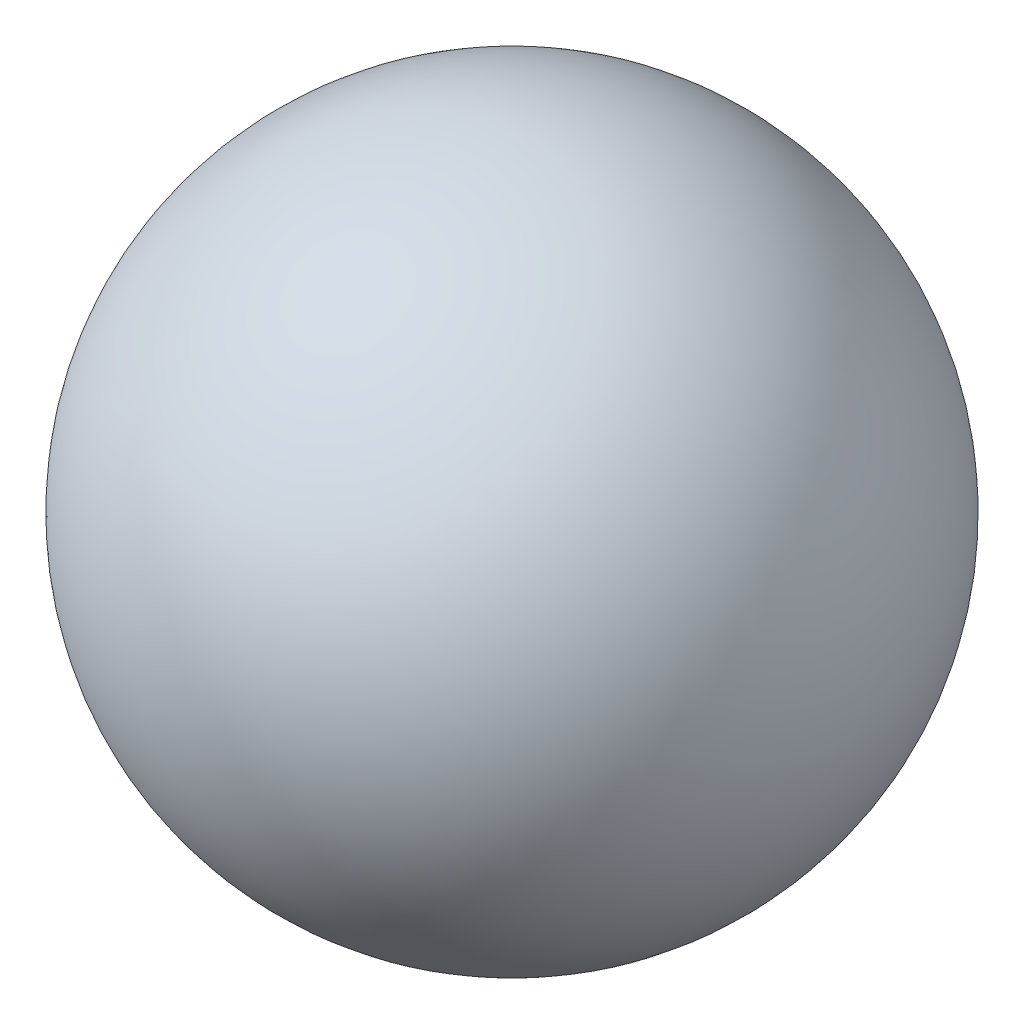
ISO-10303-21;
HEADER;
FILE_DESCRIPTION(('STEP AP214'),'2;1');
FILE_NAME('part.step','',(''),(''),'','','');
FILE_SCHEMA(('AUTOMOTIVE_DESIGN { 1 0 10303 214 1 1 1 1 }'));
ENDSEC;
DATA;
#1=APPLICATION_CONTEXT('core data for automotive mechanical design processes');
#2=APPLICATION_PROTOCOL_DEFINITION('international standard','automotive_design',2000,#1);
#3=PRODUCT_CONTEXT('',#1,'mechanical');
#4=PRODUCT('Part','Part','',(#3));
#5=PRODUCT_RELATED_PRODUCT_CATEGORY('part','',(#4));
#6=PRODUCT_DEFINITION_FORMATION('','',#4);
#7=PRODUCT_DEFINITION_CONTEXT('part definition',#1,'design');
#8=PRODUCT_DEFINITION('design','',#6,#7);
#9=PRODUCT_DEFINITION_SHAPE('','',#8);
#10=(LENGTH_UNIT() NAMED_UNIT(*) SI_UNIT(.MILLI.,.METRE.));
#11=(NAMED_UNIT(*) PLANE_ANGLE_UNIT() SI_UNIT($,.RADIAN.));
#12=(NAMED_UNIT(*) SI_UNIT($,.STERADIAN.) SOLID_ANGLE_UNIT());
#13=UNCERTAINTY_MEASURE_WITH_UNIT(LENGTH_MEASURE(1.E-05),#10,'distance_accuracy_value','');
#14=(GEOMETRIC_REPRESENTATION_CONTEXT(3) GLOBAL_UNCERTAINTY_ASSIGNED_CONTEXT((#13)) GLOBAL_UNIT_ASSIGNED_CONTEXT((#10,
#11,#12)) REPRESENTATION_CONTEXT('',''));
#15=CARTESIAN_POINT('',(0.,0.,0.));
#16=DIRECTION('',(0.,0.,1.));
#17=DIRECTION('',(1.,0.,0.));
#18=AXIS2_PLACEMENT_3D('',#15,#16,#17);
#19=CARTESIAN_POINT('',(1.979580120901,0.,2.482314956836));
#20=DIRECTION('',(0.,-1.,0.));
#21=DIRECTION('',(-0.781831482468035,0.,0.623489801858728));
#22=AXIS2_PLACEMENT_3D('',#19,#20,#21);
#23=SPHERICAL_SURFACE('',#22,0.794);
#24=CARTESIAN_POINT('',(1.979580120901,-0.794,2.482314956836));
#25=VERTEX_POINT('',#24);
#26=VERTEX_LOOP('',#25);
#27=FACE_BOUND('',#26,.T.);
#28=ADVANCED_FACE('F12',(#27),#23,.T.);
#29=CLOSED_SHELL('',(#28));
#30=MANIFOLD_SOLID_BREP('B1',#29);
#31=ADVANCED_BREP_SHAPE_REPRESENTATION('',(#18,#30),#14);
#32=SHAPE_DEFINITION_REPRESENTATION(#9,#31);
ENDSEC;
END-ISO-10303-21;
